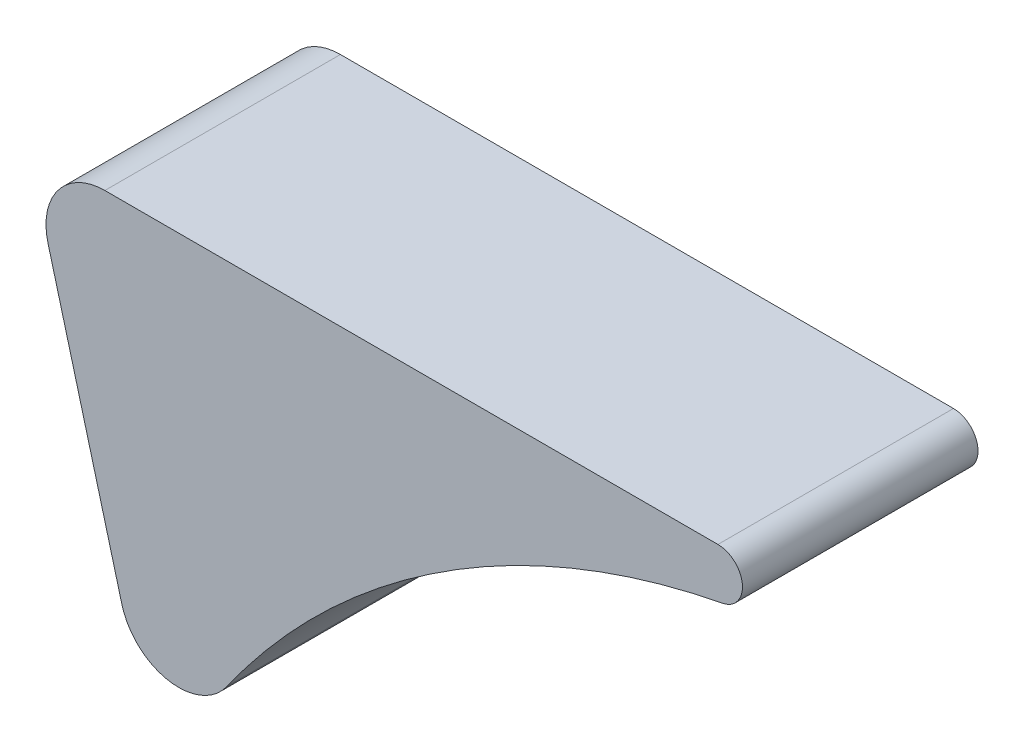
ISO-10303-21;
HEADER;
FILE_DESCRIPTION(('STEP AP214'),'2;1');
FILE_NAME('part.step','',(''),(''),'','','');
FILE_SCHEMA(('AUTOMOTIVE_DESIGN { 1 0 10303 214 1 1 1 1 }'));
ENDSEC;
DATA;
#1=APPLICATION_CONTEXT('core data for automotive mechanical design processes');
#2=APPLICATION_PROTOCOL_DEFINITION('international standard','automotive_design',2000,#1);
#3=PRODUCT_CONTEXT('',#1,'mechanical');
#4=PRODUCT('Part','Part','',(#3));
#5=PRODUCT_RELATED_PRODUCT_CATEGORY('part','',(#4));
#6=PRODUCT_DEFINITION_FORMATION('','',#4);
#7=PRODUCT_DEFINITION_CONTEXT('part definition',#1,'design');
#8=PRODUCT_DEFINITION('design','',#6,#7);
#9=PRODUCT_DEFINITION_SHAPE('','',#8);
#10=(LENGTH_UNIT() NAMED_UNIT(*) SI_UNIT(.MILLI.,.METRE.));
#11=(NAMED_UNIT(*) PLANE_ANGLE_UNIT() SI_UNIT($,.RADIAN.));
#12=(NAMED_UNIT(*) SI_UNIT($,.STERADIAN.) SOLID_ANGLE_UNIT());
#13=UNCERTAINTY_MEASURE_WITH_UNIT(LENGTH_MEASURE(1.E-05),#10,'distance_accuracy_value','');
#14=(GEOMETRIC_REPRESENTATION_CONTEXT(3) GLOBAL_UNCERTAINTY_ASSIGNED_CONTEXT((#13)) GLOBAL_UNIT_ASSIGNED_CONTEXT((#10,
#11,#12)) REPRESENTATION_CONTEXT('',''));
#15=CARTESIAN_POINT('',(0.,0.,0.));
#16=DIRECTION('',(0.,0.,1.));
#17=DIRECTION('',(1.,0.,0.));
#18=AXIS2_PLACEMENT_3D('',#15,#16,#17);
#19=CARTESIAN_POINT('',(-7.85413903620251,40.75,6.));
#20=DIRECTION('',(0.,0.,-1.));
#21=DIRECTION('',(-1.,0.,0.));
#22=AXIS2_PLACEMENT_3D('',#19,#20,#21);
#23=CYLINDRICAL_SURFACE('',#22,1.25000000000001);
#24=CARTESIAN_POINT('',(-7.85413903620251,40.75,-6.));
#25=DIRECTION('',(0.,0.,1.));
#26=DIRECTION('',(-1.,0.,0.));
#27=AXIS2_PLACEMENT_3D('',#24,#25,#26);
#28=CIRCLE('',#27,1.25000000000001);
#29=CARTESIAN_POINT('',(-7.61756858330484,39.5225903614458,-6.));
#30=VERTEX_POINT('',#29);
#31=CARTESIAN_POINT('',(-7.85413903620251,42.,-6.));
#32=VERTEX_POINT('',#31);
#33=EDGE_CURVE('E123',#30,#32,#28,.T.);
#34=ORIENTED_EDGE('',*,*,#33,.T.);
#35=DIRECTION('',(0.,0.,-1.));
#36=VECTOR('',#35,1.);
#37=CARTESIAN_POINT('',(-7.85413903620251,42.,6.));
#38=LINE('',#37,#36);
#39=CARTESIAN_POINT('',(-7.85413903620251,42.,6.));
#40=VERTEX_POINT('',#39);
#41=EDGE_CURVE('E11',#40,#32,#38,.T.);
#42=ORIENTED_EDGE('',*,*,#41,.F.);
#43=CARTESIAN_POINT('',(-7.85413903620251,40.75,6.));
#44=DIRECTION('',(0.,0.,1.));
#45=DIRECTION('',(-1.,0.,0.));
#46=AXIS2_PLACEMENT_3D('',#43,#44,#45);
#47=CIRCLE('',#46,1.25000000000001);
#48=CARTESIAN_POINT('',(-7.61756858330484,39.5225903614458,6.));
#49=VERTEX_POINT('',#48);
#50=EDGE_CURVE('E133',#49,#40,#47,.T.);
#51=ORIENTED_EDGE('',*,*,#50,.F.);
#52=DIRECTION('',(0.,0.,-1.));
#53=VECTOR('',#52,1.);
#54=CARTESIAN_POINT('',(-7.61756858330484,39.5225903614458,6.));
#55=LINE('',#54,#53);
#56=EDGE_CURVE('E119',#49,#30,#55,.T.);
#57=ORIENTED_EDGE('',*,*,#56,.T.);
#58=EDGE_LOOP('',(#34,#42,#51,#57));
#59=FACE_BOUND('',#58,.T.);
#60=ADVANCED_FACE('F39',(#59),#23,.T.);
#61=CARTESIAN_POINT('',(-39.0903238814764,42.,6.));
#62=DIRECTION('',(0.,-1.,0.));
#63=DIRECTION('',(1.,0.,0.));
#64=AXIS2_PLACEMENT_3D('',#61,#62,#63);
#65=PLANE('',#64);
#66=DIRECTION('',(-1.,0.,0.));
#67=VECTOR('',#66,1.);
#68=CARTESIAN_POINT('',(-39.0903238814764,42.,-6.));
#69=LINE('',#68,#67);
#70=CARTESIAN_POINT('',(-39.0903238814764,42.,-6.));
#71=VERTEX_POINT('',#70);
#72=EDGE_CURVE('E126',#32,#71,#69,.T.);
#73=ORIENTED_EDGE('',*,*,#72,.T.);
#74=DIRECTION('',(0.,0.,-1.));
#75=VECTOR('',#74,1.);
#76=CARTESIAN_POINT('',(-39.0903238814764,42.,6.));
#77=LINE('',#76,#75);
#78=CARTESIAN_POINT('',(-39.0903238814764,42.,6.));
#79=VERTEX_POINT('',#78);
#80=EDGE_CURVE('E47',#79,#71,#77,.T.);
#81=ORIENTED_EDGE('',*,*,#80,.F.);
#82=DIRECTION('',(-1.,0.,0.));
#83=VECTOR('',#82,1.);
#84=CARTESIAN_POINT('',(-39.0903238814764,42.,6.));
#85=LINE('',#84,#83);
#86=EDGE_CURVE('E92',#40,#79,#85,.T.);
#87=ORIENTED_EDGE('',*,*,#86,.F.);
#88=ORIENTED_EDGE('',*,*,#41,.T.);
#89=EDGE_LOOP('',(#73,#81,#87,#88));
#90=FACE_BOUND('',#89,.T.);
#91=ADVANCED_FACE('F157',(#90),#65,.F.);
#92=CARTESIAN_POINT('',(-39.0903238814764,39.,6.));
#93=DIRECTION('',(0.,0.,-1.));
#94=DIRECTION('',(-1.,0.,0.));
#95=AXIS2_PLACEMENT_3D('',#92,#93,#94);
#96=CYLINDRICAL_SURFACE('',#95,3.);
#97=CARTESIAN_POINT('',(-39.0903238814764,39.,-6.));
#98=DIRECTION('',(0.,0.,1.));
#99=DIRECTION('',(-1.,0.,0.));
#100=AXIS2_PLACEMENT_3D('',#97,#98,#99);
#101=CIRCLE('',#100,3.);
#102=CARTESIAN_POINT('',(-41.9881013603436,38.2235428646924,-6.));
#103=VERTEX_POINT('',#102);
#104=EDGE_CURVE('E128',#71,#103,#101,.T.);
#105=ORIENTED_EDGE('',*,*,#104,.T.);
#106=DIRECTION('',(0.,0.,-1.));
#107=VECTOR('',#106,1.);
#108=CARTESIAN_POINT('',(-41.9881013603436,38.2235428646924,6.));
#109=LINE('',#108,#107);
#110=CARTESIAN_POINT('',(-41.9881013603436,38.2235428646924,6.));
#111=VERTEX_POINT('',#110);
#112=EDGE_CURVE('E114',#111,#103,#109,.T.);
#113=ORIENTED_EDGE('',*,*,#112,.F.);
#114=CARTESIAN_POINT('',(-39.0903238814764,39.,6.));
#115=DIRECTION('',(0.,0.,1.));
#116=DIRECTION('',(-1.,0.,0.));
#117=AXIS2_PLACEMENT_3D('',#114,#115,#116);
#118=CIRCLE('',#117,3.);
#119=EDGE_CURVE('E105',#79,#111,#118,.T.);
#120=ORIENTED_EDGE('',*,*,#119,.F.);
#121=ORIENTED_EDGE('',*,*,#80,.T.);
#122=EDGE_LOOP('',(#105,#113,#120,#121));
#123=FACE_BOUND('',#122,.T.);
#124=ADVANCED_FACE('F139',(#123),#96,.T.);
#125=CARTESIAN_POINT('',(-38.2240353912171,24.1758574248717,6.));
#126=DIRECTION('',(0.965925826289067,0.258819045102526,0.));
#127=DIRECTION('',(-0.258819045102526,0.965925826289067,0.));
#128=AXIS2_PLACEMENT_3D('',#125,#126,#127);
#129=PLANE('',#128);
#130=DIRECTION('',(0.258819045102526,-0.965925826289067,0.));
#131=VECTOR('',#130,1.);
#132=CARTESIAN_POINT('',(-38.2240353912171,24.1758574248717,-6.));
#133=LINE('',#132,#131);
#134=CARTESIAN_POINT('',(-38.2240353912171,24.1758574248717,-6.));
#135=VERTEX_POINT('',#134);
#136=EDGE_CURVE('E113',#103,#135,#133,.T.);
#137=ORIENTED_EDGE('',*,*,#136,.T.);
#138=DIRECTION('',(0.,0.,-1.));
#139=VECTOR('',#138,1.);
#140=CARTESIAN_POINT('',(-38.2240353912171,24.1758574248717,6.));
#141=LINE('',#140,#139);
#142=CARTESIAN_POINT('',(-38.2240353912171,24.1758574248717,6.));
#143=VERTEX_POINT('',#142);
#144=EDGE_CURVE('E110',#143,#135,#141,.T.);
#145=ORIENTED_EDGE('',*,*,#144,.F.);
#146=DIRECTION('',(0.258819045102526,-0.965925826289067,0.));
#147=VECTOR('',#146,1.);
#148=CARTESIAN_POINT('',(-38.2240353912171,24.1758574248717,6.));
#149=LINE('',#148,#147);
#150=EDGE_CURVE('E99',#111,#143,#149,.T.);
#151=ORIENTED_EDGE('',*,*,#150,.F.);
#152=ORIENTED_EDGE('',*,*,#112,.T.);
#153=EDGE_LOOP('',(#137,#145,#151,#152));
#154=FACE_BOUND('',#153,.T.);
#155=ADVANCED_FACE('F111',(#154),#129,.F.);
#156=CARTESIAN_POINT('',(-35.3262579123499,24.9523145601793,6.));
#157=DIRECTION('',(0.,0.,-1.));
#158=DIRECTION('',(-1.,0.,0.));
#159=AXIS2_PLACEMENT_3D('',#156,#157,#158);
#160=CYLINDRICAL_SURFACE('',#159,3.);
#161=CARTESIAN_POINT('',(-35.3262579123499,24.9523145601793,-6.));
#162=DIRECTION('',(0.,0.,1.));
#163=DIRECTION('',(-1.,0.,0.));
#164=AXIS2_PLACEMENT_3D('',#161,#162,#163);
#165=CIRCLE('',#164,3.);
#166=CARTESIAN_POINT('',(-32.875881640973,23.2215181745021,-6.));
#167=VERTEX_POINT('',#166);
#168=EDGE_CURVE('E78',#135,#167,#165,.T.);
#169=ORIENTED_EDGE('',*,*,#168,.T.);
#170=DIRECTION('',(0.,0.,-1.));
#171=VECTOR('',#170,1.);
#172=CARTESIAN_POINT('',(-32.875881640973,23.2215181745021,6.));
#173=LINE('',#172,#171);
#174=CARTESIAN_POINT('',(-32.875881640973,23.2215181745021,6.));
#175=VERTEX_POINT('',#174);
#176=EDGE_CURVE('E115',#175,#167,#173,.T.);
#177=ORIENTED_EDGE('',*,*,#176,.F.);
#178=CARTESIAN_POINT('',(-35.3262579123499,24.9523145601793,6.));
#179=DIRECTION('',(0.,0.,1.));
#180=DIRECTION('',(-1.,0.,0.));
#181=AXIS2_PLACEMENT_3D('',#178,#179,#180);
#182=CIRCLE('',#181,3.);
#183=EDGE_CURVE('E103',#143,#175,#182,.T.);
#184=ORIENTED_EDGE('',*,*,#183,.F.);
#185=ORIENTED_EDGE('',*,*,#144,.T.);
#186=EDGE_LOOP('',(#169,#177,#184,#185));
#187=FACE_BOUND('',#186,.T.);
#188=ADVANCED_FACE('F117',(#187),#160,.T.);
#189=CARTESIAN_POINT('',(0.,0.,6.));
#190=DIRECTION('',(0.,0.,-1.));
#191=DIRECTION('',(-1.,0.,0.));
#192=AXIS2_PLACEMENT_3D('',#189,#190,#191);
#193=CYLINDRICAL_SURFACE('',#192,40.25);
#194=CARTESIAN_POINT('',(0.,0.,-6.));
#195=DIRECTION('',(0.,0.,-1.));
#196=DIRECTION('',(1.,0.,0.));
#197=AXIS2_PLACEMENT_3D('',#194,#195,#196);
#198=CIRCLE('',#197,40.25);
#199=EDGE_CURVE('E84',#167,#30,#198,.T.);
#200=ORIENTED_EDGE('',*,*,#199,.T.);
#201=ORIENTED_EDGE('',*,*,#56,.F.);
#202=CARTESIAN_POINT('',(0.,0.,6.));
#203=DIRECTION('',(0.,0.,-1.));
#204=DIRECTION('',(1.,0.,0.));
#205=AXIS2_PLACEMENT_3D('',#202,#203,#204);
#206=CIRCLE('',#205,40.25);
#207=EDGE_CURVE('E55',#175,#49,#206,.T.);
#208=ORIENTED_EDGE('',*,*,#207,.F.);
#209=ORIENTED_EDGE('',*,*,#176,.T.);
#210=EDGE_LOOP('',(#200,#201,#208,#209));
#211=FACE_BOUND('',#210,.T.);
#212=ADVANCED_FACE('F146',(#211),#193,.F.);
#213=CARTESIAN_POINT('',(-7.85413903620251,40.75,6.));
#214=DIRECTION('',(0.,0.,-1.));
#215=DIRECTION('',(-1.,0.,0.));
#216=AXIS2_PLACEMENT_3D('',#213,#214,#215);
#217=PLANE('',#216);
#218=ORIENTED_EDGE('',*,*,#50,.T.);
#219=ORIENTED_EDGE('',*,*,#86,.T.);
#220=ORIENTED_EDGE('',*,*,#119,.T.);
#221=ORIENTED_EDGE('',*,*,#150,.T.);
#222=ORIENTED_EDGE('',*,*,#183,.T.);
#223=ORIENTED_EDGE('',*,*,#207,.T.);
#224=EDGE_LOOP('',(#218,#219,#220,#221,#222,#223));
#225=FACE_BOUND('',#224,.T.);
#226=ADVANCED_FACE('F101',(#225),#217,.F.);
#227=CARTESIAN_POINT('',(-7.85413903620251,40.75,-6.));
#228=DIRECTION('',(0.,0.,-1.));
#229=DIRECTION('',(-1.,0.,0.));
#230=AXIS2_PLACEMENT_3D('',#227,#228,#229);
#231=PLANE('',#230);
#232=ORIENTED_EDGE('',*,*,#33,.F.);
#233=ORIENTED_EDGE('',*,*,#199,.F.);
#234=ORIENTED_EDGE('',*,*,#168,.F.);
#235=ORIENTED_EDGE('',*,*,#136,.F.);
#236=ORIENTED_EDGE('',*,*,#104,.F.);
#237=ORIENTED_EDGE('',*,*,#72,.F.);
#238=EDGE_LOOP('',(#232,#233,#234,#235,#236,#237));
#239=FACE_BOUND('',#238,.T.);
#240=ADVANCED_FACE('F142',(#239),#231,.T.);
#241=CLOSED_SHELL('',(#60,#91,#124,#155,#188,#212,#226,#240));
#242=MANIFOLD_SOLID_BREP('B2',#241);
#243=ADVANCED_BREP_SHAPE_REPRESENTATION('',(#18,#242),#14);
#244=SHAPE_DEFINITION_REPRESENTATION(#9,#243);
ENDSEC;
END-ISO-10303-21;
